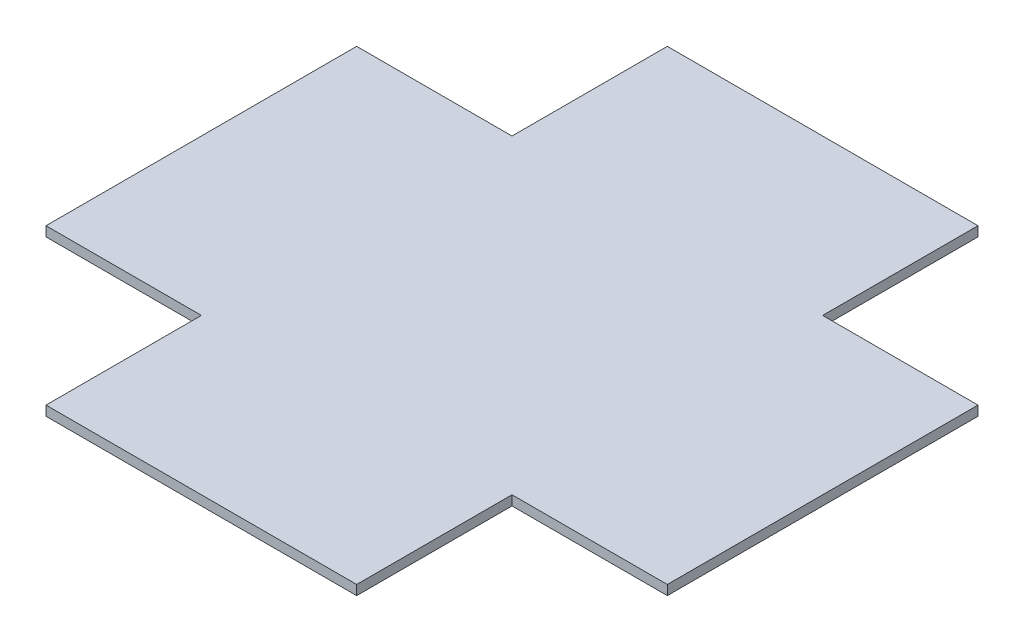
ISO-10303-21;
HEADER;
FILE_DESCRIPTION(('STEP AP214'),'2;1');
FILE_NAME('part.step','',(''),(''),'','','');
FILE_SCHEMA(('AUTOMOTIVE_DESIGN { 1 0 10303 214 1 1 1 1 }'));
ENDSEC;
DATA;
#1=APPLICATION_CONTEXT('core data for automotive mechanical design processes');
#2=APPLICATION_PROTOCOL_DEFINITION('international standard','automotive_design',2000,#1);
#3=PRODUCT_CONTEXT('',#1,'mechanical');
#4=PRODUCT('Part','Part','',(#3));
#5=PRODUCT_RELATED_PRODUCT_CATEGORY('part','',(#4));
#6=PRODUCT_DEFINITION_FORMATION('','',#4);
#7=PRODUCT_DEFINITION_CONTEXT('part definition',#1,'design');
#8=PRODUCT_DEFINITION('design','',#6,#7);
#9=PRODUCT_DEFINITION_SHAPE('','',#8);
#10=(LENGTH_UNIT() NAMED_UNIT(*) SI_UNIT(.MILLI.,.METRE.));
#11=(NAMED_UNIT(*) PLANE_ANGLE_UNIT() SI_UNIT($,.RADIAN.));
#12=(NAMED_UNIT(*) SI_UNIT($,.STERADIAN.) SOLID_ANGLE_UNIT());
#13=UNCERTAINTY_MEASURE_WITH_UNIT(LENGTH_MEASURE(1.E-05),#10,'distance_accuracy_value','');
#14=(GEOMETRIC_REPRESENTATION_CONTEXT(3) GLOBAL_UNCERTAINTY_ASSIGNED_CONTEXT((#13)) GLOBAL_UNIT_ASSIGNED_CONTEXT((#10,
#11,#12)) REPRESENTATION_CONTEXT('',''));
#15=CARTESIAN_POINT('',(0.,0.,0.));
#16=DIRECTION('',(0.,0.,1.));
#17=DIRECTION('',(1.,0.,0.));
#18=AXIS2_PLACEMENT_3D('',#15,#16,#17);
#19=CARTESIAN_POINT('',(25.4,1.5875,-50.8));
#20=DIRECTION('',(0.,0.,1.));
#21=DIRECTION('',(1.,0.,0.));
#22=AXIS2_PLACEMENT_3D('',#19,#20,#21);
#23=PLANE('',#22);
#24=DIRECTION('',(-1.,0.,0.));
#25=VECTOR('',#24,1.);
#26=CARTESIAN_POINT('',(25.4,0.,-50.8));
#27=LINE('',#26,#25);
#28=CARTESIAN_POINT('',(25.4,0.,-50.8));
#29=VERTEX_POINT('',#28);
#30=CARTESIAN_POINT('',(-25.4,0.,-50.8));
#31=VERTEX_POINT('',#30);
#32=EDGE_CURVE('E157',#29,#31,#27,.T.);
#33=ORIENTED_EDGE('',*,*,#32,.T.);
#34=DIRECTION('',(0.,-1.,0.));
#35=VECTOR('',#34,1.);
#36=CARTESIAN_POINT('',(-25.4,1.5875,-50.8));
#37=LINE('',#36,#35);
#38=CARTESIAN_POINT('',(-25.4,1.5875,-50.8));
#39=VERTEX_POINT('',#38);
#40=EDGE_CURVE('E11',#39,#31,#37,.T.);
#41=ORIENTED_EDGE('',*,*,#40,.F.);
#42=DIRECTION('',(-1.,0.,0.));
#43=VECTOR('',#42,1.);
#44=CARTESIAN_POINT('',(25.4,1.5875,-50.8));
#45=LINE('',#44,#43);
#46=CARTESIAN_POINT('',(25.4,1.5875,-50.8));
#47=VERTEX_POINT('',#46);
#48=EDGE_CURVE('E179',#47,#39,#45,.T.);
#49=ORIENTED_EDGE('',*,*,#48,.F.);
#50=DIRECTION('',(0.,-1.,0.));
#51=VECTOR('',#50,1.);
#52=CARTESIAN_POINT('',(25.4,1.5875,-50.8));
#53=LINE('',#52,#51);
#54=EDGE_CURVE('E153',#47,#29,#53,.T.);
#55=ORIENTED_EDGE('',*,*,#54,.T.);
#56=EDGE_LOOP('',(#33,#41,#49,#55));
#57=FACE_BOUND('',#56,.T.);
#58=ADVANCED_FACE('F37',(#57),#23,.F.);
#59=CARTESIAN_POINT('',(-25.4,1.5875,-50.8));
#60=DIRECTION('',(1.,0.,0.));
#61=DIRECTION('',(0.,0.,-1.));
#62=AXIS2_PLACEMENT_3D('',#59,#60,#61);
#63=PLANE('',#62);
#64=DIRECTION('',(0.,0.,1.));
#65=VECTOR('',#64,1.);
#66=CARTESIAN_POINT('',(-25.4,0.,-50.8));
#67=LINE('',#66,#65);
#68=CARTESIAN_POINT('',(-25.4,0.,-25.4));
#69=VERTEX_POINT('',#68);
#70=EDGE_CURVE('E160',#31,#69,#67,.T.);
#71=ORIENTED_EDGE('',*,*,#70,.T.);
#72=DIRECTION('',(0.,-1.,0.));
#73=VECTOR('',#72,1.);
#74=CARTESIAN_POINT('',(-25.4,1.5875,-25.4));
#75=LINE('',#74,#73);
#76=CARTESIAN_POINT('',(-25.4,1.5875,-25.4));
#77=VERTEX_POINT('',#76);
#78=EDGE_CURVE('E45',#77,#69,#75,.T.);
#79=ORIENTED_EDGE('',*,*,#78,.F.);
#80=DIRECTION('',(0.,0.,1.));
#81=VECTOR('',#80,1.);
#82=CARTESIAN_POINT('',(-25.4,1.5875,-50.8));
#83=LINE('',#82,#81);
#84=EDGE_CURVE('E108',#39,#77,#83,.T.);
#85=ORIENTED_EDGE('',*,*,#84,.F.);
#86=ORIENTED_EDGE('',*,*,#40,.T.);
#87=EDGE_LOOP('',(#71,#79,#85,#86));
#88=FACE_BOUND('',#87,.T.);
#89=ADVANCED_FACE('F257',(#88),#63,.F.);
#90=CARTESIAN_POINT('',(-25.4,1.5875,-25.4));
#91=DIRECTION('',(0.,0.,1.));
#92=DIRECTION('',(1.,0.,0.));
#93=AXIS2_PLACEMENT_3D('',#90,#91,#92);
#94=PLANE('',#93);
#95=DIRECTION('',(-1.,0.,0.));
#96=VECTOR('',#95,1.);
#97=CARTESIAN_POINT('',(-25.4,0.,-25.4));
#98=LINE('',#97,#96);
#99=CARTESIAN_POINT('',(-50.8,0.,-25.4));
#100=VERTEX_POINT('',#99);
#101=EDGE_CURVE('E162',#69,#100,#98,.T.);
#102=ORIENTED_EDGE('',*,*,#101,.T.);
#103=DIRECTION('',(0.,-1.,0.));
#104=VECTOR('',#103,1.);
#105=CARTESIAN_POINT('',(-50.8,1.5875,-25.4));
#106=LINE('',#105,#104);
#107=CARTESIAN_POINT('',(-50.8,1.5875,-25.4));
#108=VERTEX_POINT('',#107);
#109=EDGE_CURVE('E198',#108,#100,#106,.T.);
#110=ORIENTED_EDGE('',*,*,#109,.F.);
#111=DIRECTION('',(-1.,0.,0.));
#112=VECTOR('',#111,1.);
#113=CARTESIAN_POINT('',(-25.4,1.5875,-25.4));
#114=LINE('',#113,#112);
#115=EDGE_CURVE('E206',#77,#108,#114,.T.);
#116=ORIENTED_EDGE('',*,*,#115,.F.);
#117=ORIENTED_EDGE('',*,*,#78,.T.);
#118=EDGE_LOOP('',(#102,#110,#116,#117));
#119=FACE_BOUND('',#118,.T.);
#120=ADVANCED_FACE('F204',(#119),#94,.F.);
#121=CARTESIAN_POINT('',(-50.8,1.5875,-25.4));
#122=DIRECTION('',(1.,0.,0.));
#123=DIRECTION('',(0.,0.,-1.));
#124=AXIS2_PLACEMENT_3D('',#121,#122,#123);
#125=PLANE('',#124);
#126=DIRECTION('',(0.,0.,1.));
#127=VECTOR('',#126,1.);
#128=CARTESIAN_POINT('',(-50.8,0.,-25.4));
#129=LINE('',#128,#127);
#130=CARTESIAN_POINT('',(-50.8,0.,25.4));
#131=VERTEX_POINT('',#130);
#132=EDGE_CURVE('E164',#100,#131,#129,.T.);
#133=ORIENTED_EDGE('',*,*,#132,.T.);
#134=DIRECTION('',(0.,-1.,0.));
#135=VECTOR('',#134,1.);
#136=CARTESIAN_POINT('',(-50.8,1.5875,25.4));
#137=LINE('',#136,#135);
#138=CARTESIAN_POINT('',(-50.8,1.5875,25.4));
#139=VERTEX_POINT('',#138);
#140=EDGE_CURVE('E195',#139,#131,#137,.T.);
#141=ORIENTED_EDGE('',*,*,#140,.F.);
#142=DIRECTION('',(0.,0.,1.));
#143=VECTOR('',#142,1.);
#144=CARTESIAN_POINT('',(-50.8,1.5875,-25.4));
#145=LINE('',#144,#143);
#146=EDGE_CURVE('E224',#108,#139,#145,.T.);
#147=ORIENTED_EDGE('',*,*,#146,.F.);
#148=ORIENTED_EDGE('',*,*,#109,.T.);
#149=EDGE_LOOP('',(#133,#141,#147,#148));
#150=FACE_BOUND('',#149,.T.);
#151=ADVANCED_FACE('F215',(#150),#125,.F.);
#152=CARTESIAN_POINT('',(-50.8,1.5875,25.4));
#153=DIRECTION('',(0.,0.,-1.));
#154=DIRECTION('',(-1.,0.,0.));
#155=AXIS2_PLACEMENT_3D('',#152,#153,#154);
#156=PLANE('',#155);
#157=DIRECTION('',(1.,0.,0.));
#158=VECTOR('',#157,1.);
#159=CARTESIAN_POINT('',(-50.8,0.,25.4));
#160=LINE('',#159,#158);
#161=CARTESIAN_POINT('',(-25.4,0.,25.4));
#162=VERTEX_POINT('',#161);
#163=EDGE_CURVE('E166',#131,#162,#160,.T.);
#164=ORIENTED_EDGE('',*,*,#163,.T.);
#165=DIRECTION('',(0.,-1.,0.));
#166=VECTOR('',#165,1.);
#167=CARTESIAN_POINT('',(-25.4,1.5875,25.4));
#168=LINE('',#167,#166);
#169=CARTESIAN_POINT('',(-25.4,1.5875,25.4));
#170=VERTEX_POINT('',#169);
#171=EDGE_CURVE('E192',#170,#162,#168,.T.);
#172=ORIENTED_EDGE('',*,*,#171,.F.);
#173=DIRECTION('',(1.,0.,0.));
#174=VECTOR('',#173,1.);
#175=CARTESIAN_POINT('',(-50.8,1.5875,25.4));
#176=LINE('',#175,#174);
#177=EDGE_CURVE('E221',#139,#170,#176,.T.);
#178=ORIENTED_EDGE('',*,*,#177,.F.);
#179=ORIENTED_EDGE('',*,*,#140,.T.);
#180=EDGE_LOOP('',(#164,#172,#178,#179));
#181=FACE_BOUND('',#180,.T.);
#182=ADVANCED_FACE('F219',(#181),#156,.F.);
#183=CARTESIAN_POINT('',(-25.4,1.5875,25.4));
#184=DIRECTION('',(1.,0.,0.));
#185=DIRECTION('',(0.,0.,-1.));
#186=AXIS2_PLACEMENT_3D('',#183,#184,#185);
#187=PLANE('',#186);
#188=DIRECTION('',(0.,0.,1.));
#189=VECTOR('',#188,1.);
#190=CARTESIAN_POINT('',(-25.4,0.,25.4));
#191=LINE('',#190,#189);
#192=CARTESIAN_POINT('',(-25.4,0.,50.8));
#193=VERTEX_POINT('',#192);
#194=EDGE_CURVE('E168',#162,#193,#191,.T.);
#195=ORIENTED_EDGE('',*,*,#194,.T.);
#196=DIRECTION('',(0.,-1.,0.));
#197=VECTOR('',#196,1.);
#198=CARTESIAN_POINT('',(-25.4,1.5875,50.8));
#199=LINE('',#198,#197);
#200=CARTESIAN_POINT('',(-25.4,1.5875,50.8));
#201=VERTEX_POINT('',#200);
#202=EDGE_CURVE('E189',#201,#193,#199,.T.);
#203=ORIENTED_EDGE('',*,*,#202,.F.);
#204=DIRECTION('',(0.,0.,1.));
#205=VECTOR('',#204,1.);
#206=CARTESIAN_POINT('',(-25.4,1.5875,25.4));
#207=LINE('',#206,#205);
#208=EDGE_CURVE('E223',#170,#201,#207,.T.);
#209=ORIENTED_EDGE('',*,*,#208,.F.);
#210=ORIENTED_EDGE('',*,*,#171,.T.);
#211=EDGE_LOOP('',(#195,#203,#209,#210));
#212=FACE_BOUND('',#211,.T.);
#213=ADVANCED_FACE('F270',(#212),#187,.F.);
#214=CARTESIAN_POINT('',(-25.4,1.5875,50.8));
#215=DIRECTION('',(0.,0.,-1.));
#216=DIRECTION('',(-1.,0.,0.));
#217=AXIS2_PLACEMENT_3D('',#214,#215,#216);
#218=PLANE('',#217);
#219=DIRECTION('',(1.,0.,0.));
#220=VECTOR('',#219,1.);
#221=CARTESIAN_POINT('',(-25.4,0.,50.8));
#222=LINE('',#221,#220);
#223=CARTESIAN_POINT('',(25.4,0.,50.8));
#224=VERTEX_POINT('',#223);
#225=EDGE_CURVE('E170',#193,#224,#222,.T.);
#226=ORIENTED_EDGE('',*,*,#225,.T.);
#227=DIRECTION('',(0.,-1.,0.));
#228=VECTOR('',#227,1.);
#229=CARTESIAN_POINT('',(25.4,1.5875,50.8));
#230=LINE('',#229,#228);
#231=CARTESIAN_POINT('',(25.4,1.5875,50.8));
#232=VERTEX_POINT('',#231);
#233=EDGE_CURVE('E186',#232,#224,#230,.T.);
#234=ORIENTED_EDGE('',*,*,#233,.F.);
#235=DIRECTION('',(1.,0.,0.));
#236=VECTOR('',#235,1.);
#237=CARTESIAN_POINT('',(-25.4,1.5875,50.8));
#238=LINE('',#237,#236);
#239=EDGE_CURVE('E226',#201,#232,#238,.T.);
#240=ORIENTED_EDGE('',*,*,#239,.F.);
#241=ORIENTED_EDGE('',*,*,#202,.T.);
#242=EDGE_LOOP('',(#226,#234,#240,#241));
#243=FACE_BOUND('',#242,.T.);
#244=ADVANCED_FACE('F273',(#243),#218,.F.);
#245=CARTESIAN_POINT('',(25.4,1.5875,50.8));
#246=DIRECTION('',(-1.,0.,0.));
#247=DIRECTION('',(0.,0.,1.));
#248=AXIS2_PLACEMENT_3D('',#245,#246,#247);
#249=PLANE('',#248);
#250=DIRECTION('',(0.,0.,-1.));
#251=VECTOR('',#250,1.);
#252=CARTESIAN_POINT('',(25.4,0.,50.8));
#253=LINE('',#252,#251);
#254=CARTESIAN_POINT('',(25.4,0.,25.4));
#255=VERTEX_POINT('',#254);
#256=EDGE_CURVE('E172',#224,#255,#253,.T.);
#257=ORIENTED_EDGE('',*,*,#256,.T.);
#258=DIRECTION('',(0.,-1.,0.));
#259=VECTOR('',#258,1.);
#260=CARTESIAN_POINT('',(25.4,1.5875,25.4));
#261=LINE('',#260,#259);
#262=CARTESIAN_POINT('',(25.4,1.5875,25.4));
#263=VERTEX_POINT('',#262);
#264=EDGE_CURVE('E183',#263,#255,#261,.T.);
#265=ORIENTED_EDGE('',*,*,#264,.F.);
#266=DIRECTION('',(0.,0.,-1.));
#267=VECTOR('',#266,1.);
#268=CARTESIAN_POINT('',(25.4,1.5875,50.8));
#269=LINE('',#268,#267);
#270=EDGE_CURVE('E232',#232,#263,#269,.T.);
#271=ORIENTED_EDGE('',*,*,#270,.F.);
#272=ORIENTED_EDGE('',*,*,#233,.T.);
#273=EDGE_LOOP('',(#257,#265,#271,#272));
#274=FACE_BOUND('',#273,.T.);
#275=ADVANCED_FACE('F238',(#274),#249,.F.);
#276=CARTESIAN_POINT('',(25.4,1.5875,25.4));
#277=DIRECTION('',(0.,0.,-1.));
#278=DIRECTION('',(-1.,0.,0.));
#279=AXIS2_PLACEMENT_3D('',#276,#277,#278);
#280=PLANE('',#279);
#281=DIRECTION('',(1.,0.,0.));
#282=VECTOR('',#281,1.);
#283=CARTESIAN_POINT('',(25.4,0.,25.4));
#284=LINE('',#283,#282);
#285=CARTESIAN_POINT('',(50.8,0.,25.4));
#286=VERTEX_POINT('',#285);
#287=EDGE_CURVE('E174',#255,#286,#284,.T.);
#288=ORIENTED_EDGE('',*,*,#287,.T.);
#289=DIRECTION('',(0.,-1.,0.));
#290=VECTOR('',#289,1.);
#291=CARTESIAN_POINT('',(50.8,1.5875,25.4));
#292=LINE('',#291,#290);
#293=CARTESIAN_POINT('',(50.8,1.5875,25.4));
#294=VERTEX_POINT('',#293);
#295=EDGE_CURVE('E148',#294,#286,#292,.T.);
#296=ORIENTED_EDGE('',*,*,#295,.F.);
#297=DIRECTION('',(1.,0.,0.));
#298=VECTOR('',#297,1.);
#299=CARTESIAN_POINT('',(25.4,1.5875,25.4));
#300=LINE('',#299,#298);
#301=EDGE_CURVE('E139',#263,#294,#300,.T.);
#302=ORIENTED_EDGE('',*,*,#301,.F.);
#303=ORIENTED_EDGE('',*,*,#264,.T.);
#304=EDGE_LOOP('',(#288,#296,#302,#303));
#305=FACE_BOUND('',#304,.T.);
#306=ADVANCED_FACE('F242',(#305),#280,.F.);
#307=CARTESIAN_POINT('',(50.8,1.5875,25.4));
#308=DIRECTION('',(-1.,0.,0.));
#309=DIRECTION('',(0.,0.,1.));
#310=AXIS2_PLACEMENT_3D('',#307,#308,#309);
#311=PLANE('',#310);
#312=DIRECTION('',(0.,0.,-1.));
#313=VECTOR('',#312,1.);
#314=CARTESIAN_POINT('',(50.8,0.,25.4));
#315=LINE('',#314,#313);
#316=CARTESIAN_POINT('',(50.8,0.,-25.4));
#317=VERTEX_POINT('',#316);
#318=EDGE_CURVE('E147',#286,#317,#315,.T.);
#319=ORIENTED_EDGE('',*,*,#318,.T.);
#320=DIRECTION('',(0.,-1.,0.));
#321=VECTOR('',#320,1.);
#322=CARTESIAN_POINT('',(50.8,1.5875,-25.4));
#323=LINE('',#322,#321);
#324=CARTESIAN_POINT('',(50.8,1.5875,-25.4));
#325=VERTEX_POINT('',#324);
#326=EDGE_CURVE('E144',#325,#317,#323,.T.);
#327=ORIENTED_EDGE('',*,*,#326,.F.);
#328=DIRECTION('',(0.,0.,-1.));
#329=VECTOR('',#328,1.);
#330=CARTESIAN_POINT('',(50.8,1.5875,25.4));
#331=LINE('',#330,#329);
#332=EDGE_CURVE('E133',#294,#325,#331,.T.);
#333=ORIENTED_EDGE('',*,*,#332,.F.);
#334=ORIENTED_EDGE('',*,*,#295,.T.);
#335=EDGE_LOOP('',(#319,#327,#333,#334));
#336=FACE_BOUND('',#335,.T.);
#337=ADVANCED_FACE('F145',(#336),#311,.F.);
#338=CARTESIAN_POINT('',(50.8,1.5875,-25.4));
#339=DIRECTION('',(0.,0.,1.));
#340=DIRECTION('',(1.,0.,0.));
#341=AXIS2_PLACEMENT_3D('',#338,#339,#340);
#342=PLANE('',#341);
#343=DIRECTION('',(-1.,0.,0.));
#344=VECTOR('',#343,1.);
#345=CARTESIAN_POINT('',(50.8,0.,-25.4));
#346=LINE('',#345,#344);
#347=CARTESIAN_POINT('',(25.4,0.,-25.4));
#348=VERTEX_POINT('',#347);
#349=EDGE_CURVE('E94',#317,#348,#346,.T.);
#350=ORIENTED_EDGE('',*,*,#349,.T.);
#351=DIRECTION('',(0.,-1.,0.));
#352=VECTOR('',#351,1.);
#353=CARTESIAN_POINT('',(25.4,1.5875,-25.4));
#354=LINE('',#353,#352);
#355=CARTESIAN_POINT('',(25.4,1.5875,-25.4));
#356=VERTEX_POINT('',#355);
#357=EDGE_CURVE('E149',#356,#348,#354,.T.);
#358=ORIENTED_EDGE('',*,*,#357,.F.);
#359=DIRECTION('',(-1.,0.,0.));
#360=VECTOR('',#359,1.);
#361=CARTESIAN_POINT('',(50.8,1.5875,-25.4));
#362=LINE('',#361,#360);
#363=EDGE_CURVE('E137',#325,#356,#362,.T.);
#364=ORIENTED_EDGE('',*,*,#363,.F.);
#365=ORIENTED_EDGE('',*,*,#326,.T.);
#366=EDGE_LOOP('',(#350,#358,#364,#365));
#367=FACE_BOUND('',#366,.T.);
#368=ADVANCED_FACE('F151',(#367),#342,.F.);
#369=CARTESIAN_POINT('',(25.4,1.5875,-25.4));
#370=DIRECTION('',(-1.,0.,0.));
#371=DIRECTION('',(0.,0.,1.));
#372=AXIS2_PLACEMENT_3D('',#369,#370,#371);
#373=PLANE('',#372);
#374=DIRECTION('',(0.,0.,-1.));
#375=VECTOR('',#374,1.);
#376=CARTESIAN_POINT('',(25.4,0.,-25.4));
#377=LINE('',#376,#375);
#378=EDGE_CURVE('E100',#348,#29,#377,.T.);
#379=ORIENTED_EDGE('',*,*,#378,.T.);
#380=ORIENTED_EDGE('',*,*,#54,.F.);
#381=DIRECTION('',(0.,0.,-1.));
#382=VECTOR('',#381,1.);
#383=CARTESIAN_POINT('',(25.4,1.5875,-25.4));
#384=LINE('',#383,#382);
#385=EDGE_CURVE('E53',#356,#47,#384,.T.);
#386=ORIENTED_EDGE('',*,*,#385,.F.);
#387=ORIENTED_EDGE('',*,*,#357,.T.);
#388=EDGE_LOOP('',(#379,#380,#386,#387));
#389=FACE_BOUND('',#388,.T.);
#390=ADVANCED_FACE('F246',(#389),#373,.F.);
#391=CARTESIAN_POINT('',(0.,1.5875,0.));
#392=DIRECTION('',(0.,1.,0.));
#393=DIRECTION('',(0.,0.,1.));
#394=AXIS2_PLACEMENT_3D('',#391,#392,#393);
#395=PLANE('',#394);
#396=ORIENTED_EDGE('',*,*,#48,.T.);
#397=ORIENTED_EDGE('',*,*,#84,.T.);
#398=ORIENTED_EDGE('',*,*,#115,.T.);
#399=ORIENTED_EDGE('',*,*,#146,.T.);
#400=ORIENTED_EDGE('',*,*,#177,.T.);
#401=ORIENTED_EDGE('',*,*,#208,.T.);
#402=ORIENTED_EDGE('',*,*,#239,.T.);
#403=ORIENTED_EDGE('',*,*,#270,.T.);
#404=ORIENTED_EDGE('',*,*,#301,.T.);
#405=ORIENTED_EDGE('',*,*,#332,.T.);
#406=ORIENTED_EDGE('',*,*,#363,.T.);
#407=ORIENTED_EDGE('',*,*,#385,.T.);
#408=EDGE_LOOP('',(#396,#397,#398,#399,#400,#401,#402,#403,#404,#405,#406,#407));
#409=FACE_BOUND('',#408,.T.);
#410=ADVANCED_FACE('F135',(#409),#395,.T.);
#411=CARTESIAN_POINT('',(0.,0.,0.));
#412=DIRECTION('',(0.,1.,0.));
#413=DIRECTION('',(0.,0.,1.));
#414=AXIS2_PLACEMENT_3D('',#411,#412,#413);
#415=PLANE('',#414);
#416=ORIENTED_EDGE('',*,*,#32,.F.);
#417=ORIENTED_EDGE('',*,*,#378,.F.);
#418=ORIENTED_EDGE('',*,*,#349,.F.);
#419=ORIENTED_EDGE('',*,*,#318,.F.);
#420=ORIENTED_EDGE('',*,*,#287,.F.);
#421=ORIENTED_EDGE('',*,*,#256,.F.);
#422=ORIENTED_EDGE('',*,*,#225,.F.);
#423=ORIENTED_EDGE('',*,*,#194,.F.);
#424=ORIENTED_EDGE('',*,*,#163,.F.);
#425=ORIENTED_EDGE('',*,*,#132,.F.);
#426=ORIENTED_EDGE('',*,*,#101,.F.);
#427=ORIENTED_EDGE('',*,*,#70,.F.);
#428=EDGE_LOOP('',(#416,#417,#418,#419,#420,#421,#422,#423,#424,#425,#426,#427));
#429=FACE_BOUND('',#428,.T.);
#430=ADVANCED_FACE('F210',(#429),#415,.F.);
#431=CLOSED_SHELL('',(#58,#89,#120,#151,#182,#213,#244,#275,#306,#337,#368,#390,#410,#430));
#432=MANIFOLD_SOLID_BREP('B2',#431);
#433=ADVANCED_BREP_SHAPE_REPRESENTATION('',(#18,#432),#14);
#434=SHAPE_DEFINITION_REPRESENTATION(#9,#433);
ENDSEC;
END-ISO-10303-21;
